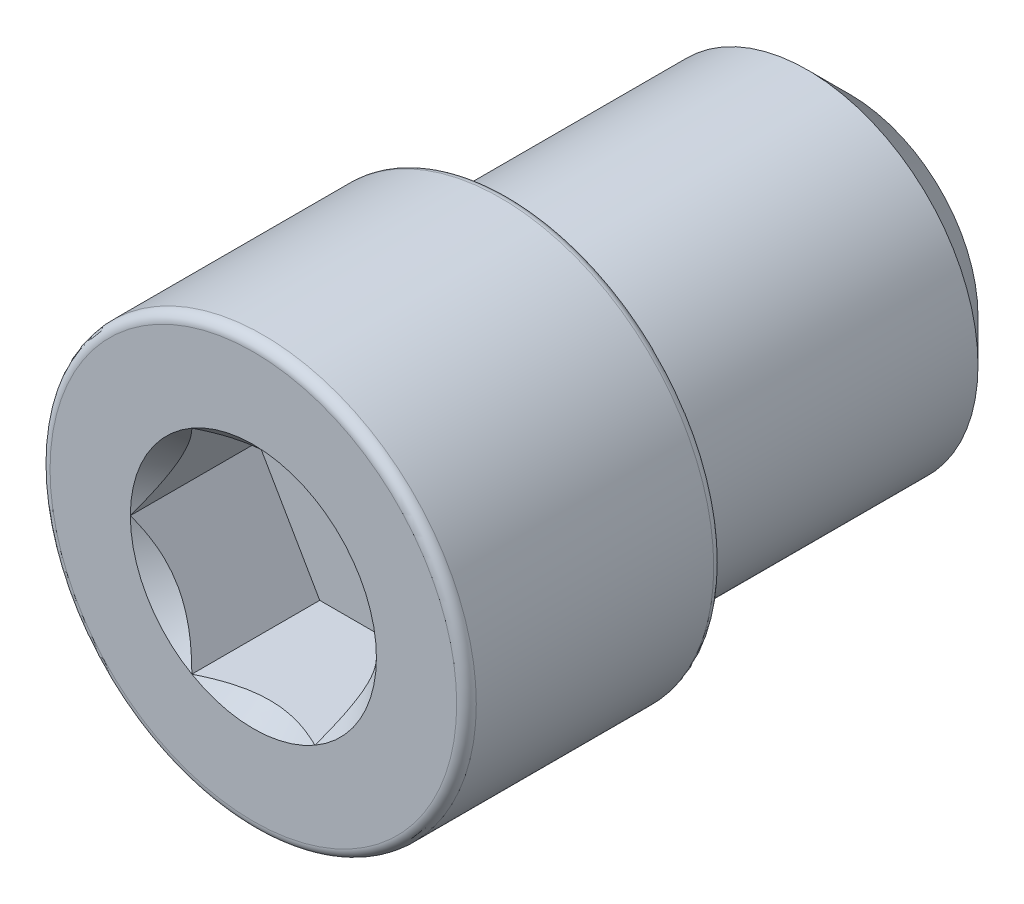
ISO-10303-21;
HEADER;
FILE_DESCRIPTION(('STEP AP214'),'2;1');
FILE_NAME('part.step','',(''),(''),'','','');
FILE_SCHEMA(('AUTOMOTIVE_DESIGN { 1 0 10303 214 1 1 1 1 }'));
ENDSEC;
DATA;
#1=APPLICATION_CONTEXT('core data for automotive mechanical design processes');
#2=APPLICATION_PROTOCOL_DEFINITION('international standard','automotive_design',2000,#1);
#3=PRODUCT_CONTEXT('',#1,'mechanical');
#4=PRODUCT('Part','Part','',(#3));
#5=PRODUCT_RELATED_PRODUCT_CATEGORY('part','',(#4));
#6=PRODUCT_DEFINITION_FORMATION('','',#4);
#7=PRODUCT_DEFINITION_CONTEXT('part definition',#1,'design');
#8=PRODUCT_DEFINITION('design','',#6,#7);
#9=PRODUCT_DEFINITION_SHAPE('','',#8);
#10=(LENGTH_UNIT() NAMED_UNIT(*) SI_UNIT(.MILLI.,.METRE.));
#11=(NAMED_UNIT(*) PLANE_ANGLE_UNIT() SI_UNIT($,.RADIAN.));
#12=(NAMED_UNIT(*) SI_UNIT($,.STERADIAN.) SOLID_ANGLE_UNIT());
#13=UNCERTAINTY_MEASURE_WITH_UNIT(LENGTH_MEASURE(1.E-05),#10,'distance_accuracy_value','');
#14=(GEOMETRIC_REPRESENTATION_CONTEXT(3) GLOBAL_UNCERTAINTY_ASSIGNED_CONTEXT((#13)) GLOBAL_UNIT_ASSIGNED_CONTEXT((#10,
#11,#12)) REPRESENTATION_CONTEXT('',''));
#15=CARTESIAN_POINT('',(0.,0.,0.));
#16=DIRECTION('',(0.,0.,1.));
#17=DIRECTION('',(1.,0.,0.));
#18=AXIS2_PLACEMENT_3D('',#15,#16,#17);
#19=CARTESIAN_POINT('',(0.,0.,8.));
#20=DIRECTION('',(0.,0.,-1.));
#21=DIRECTION('',(-1.,0.,0.));
#22=AXIS2_PLACEMENT_3D('',#19,#20,#21);
#23=CYLINDRICAL_SURFACE('',#22,4.);
#24=CARTESIAN_POINT('',(0.,0.,0.999999999999999));
#25=DIRECTION('',(0.,0.,1.));
#26=DIRECTION('',(1.,0.,0.));
#27=AXIS2_PLACEMENT_3D('',#24,#25,#26);
#28=CIRCLE('',#27,4.);
#29=CARTESIAN_POINT('',(4.,0.,0.999999999999999));
#30=VERTEX_POINT('',#29);
#31=EDGE_CURVE('E313',#30,#30,#28,.T.);
#32=ORIENTED_EDGE('',*,*,#31,.T.);
#33=EDGE_LOOP('',(#32));
#34=FACE_BOUND('',#33,.T.);
#35=CARTESIAN_POINT('',(0.,0.,8.));
#36=DIRECTION('',(0.,0.,1.));
#37=DIRECTION('',(1.,0.,0.));
#38=AXIS2_PLACEMENT_3D('',#35,#36,#37);
#39=CIRCLE('',#38,4.);
#40=CARTESIAN_POINT('',(4.,0.,8.));
#41=VERTEX_POINT('',#40);
#42=EDGE_CURVE('E297',#41,#41,#39,.T.);
#43=ORIENTED_EDGE('',*,*,#42,.F.);
#44=EDGE_LOOP('',(#43));
#45=FACE_BOUND('',#44,.T.);
#46=ADVANCED_FACE('F41',(#34,#45),#23,.T.);
#47=CARTESIAN_POINT('',(0.,0.,0.));
#48=DIRECTION('',(0.,0.,1.));
#49=DIRECTION('',(1.,0.,0.));
#50=AXIS2_PLACEMENT_3D('',#47,#48,#49);
#51=PLANE('',#50);
#52=CARTESIAN_POINT('',(0.,0.,0.));
#53=DIRECTION('',(0.,0.,1.));
#54=DIRECTION('',(1.,0.,0.));
#55=AXIS2_PLACEMENT_3D('',#52,#53,#54);
#56=CIRCLE('',#55,3.);
#57=CARTESIAN_POINT('',(3.,0.,0.));
#58=VERTEX_POINT('',#57);
#59=EDGE_CURVE('E118',#58,#58,#56,.F.);
#60=ORIENTED_EDGE('',*,*,#59,.T.);
#61=EDGE_LOOP('',(#60));
#62=FACE_BOUND('',#61,.T.);
#63=ADVANCED_FACE('F217',(#62),#51,.F.);
#64=CARTESIAN_POINT('',(0.,0.,0.999999999999999));
#65=DIRECTION('',(0.,0.,1.));
#66=DIRECTION('',(1.,0.,0.));
#67=AXIS2_PLACEMENT_3D('',#64,#65,#66);
#68=CONICAL_SURFACE('',#67,4.,0.78539816339745);
#69=ORIENTED_EDGE('',*,*,#59,.F.);
#70=EDGE_LOOP('',(#69));
#71=FACE_BOUND('',#70,.T.);
#72=ORIENTED_EDGE('',*,*,#31,.F.);
#73=EDGE_LOOP('',(#72));
#74=FACE_BOUND('',#73,.T.);
#75=ADVANCED_FACE('F223',(#71,#74),#68,.T.);
#76=CARTESIAN_POINT('',(0.,0.,14.));
#77=DIRECTION('',(0.,0.,-1.));
#78=DIRECTION('',(-1.,0.,0.));
#79=AXIS2_PLACEMENT_3D('',#76,#77,#78);
#80=CYLINDRICAL_SURFACE('',#79,5.);
#81=CARTESIAN_POINT('',(0.,0.,8.2));
#82=DIRECTION('',(0.,0.,1.));
#83=DIRECTION('',(1.,0.,0.));
#84=AXIS2_PLACEMENT_3D('',#81,#82,#83);
#85=CIRCLE('',#84,5.);
#86=CARTESIAN_POINT('',(5.,0.,8.2));
#87=VERTEX_POINT('',#86);
#88=EDGE_CURVE('E50',#87,#87,#85,.T.);
#89=ORIENTED_EDGE('',*,*,#88,.T.);
#90=EDGE_LOOP('',(#89));
#91=FACE_BOUND('',#90,.T.);
#92=CARTESIAN_POINT('',(0.,0.,13.77));
#93=DIRECTION('',(0.,0.,1.));
#94=DIRECTION('',(1.,0.,0.));
#95=AXIS2_PLACEMENT_3D('',#92,#93,#94);
#96=CIRCLE('',#95,5.);
#97=CARTESIAN_POINT('',(5.,0.,13.77));
#98=VERTEX_POINT('',#97);
#99=EDGE_CURVE('E244',#98,#98,#96,.F.);
#100=ORIENTED_EDGE('',*,*,#99,.T.);
#101=EDGE_LOOP('',(#100));
#102=FACE_BOUND('',#101,.T.);
#103=ADVANCED_FACE('F231',(#91,#102),#80,.T.);
#104=CARTESIAN_POINT('',(0.,0.,14.));
#105=DIRECTION('',(0.,0.,1.));
#106=DIRECTION('',(1.,0.,0.));
#107=AXIS2_PLACEMENT_3D('',#104,#105,#106);
#108=PLANE('',#107);
#109=CARTESIAN_POINT('',(0.,0.,14.));
#110=DIRECTION('',(0.,0.,1.));
#111=DIRECTION('',(1.,0.,0.));
#112=AXIS2_PLACEMENT_3D('',#109,#110,#111);
#113=CIRCLE('',#112,4.77);
#114=CARTESIAN_POINT('',(4.77,0.,14.));
#115=VERTEX_POINT('',#114);
#116=EDGE_CURVE('E117',#115,#115,#113,.T.);
#117=ORIENTED_EDGE('',*,*,#116,.T.);
#118=EDGE_LOOP('',(#117));
#119=FACE_BOUND('',#118,.T.);
#120=CARTESIAN_POINT('',(0.,0.,14.));
#121=DIRECTION('',(0.,0.,1.));
#122=DIRECTION('',(1.,0.,0.));
#123=AXIS2_PLACEMENT_3D('',#120,#121,#122);
#124=CIRCLE('',#123,2.88675134594813);
#125=CARTESIAN_POINT('',(2.88675134594813,0.,14.));
#126=VERTEX_POINT('',#125);
#127=CARTESIAN_POINT('',(1.44337567297406,2.5,14.));
#128=VERTEX_POINT('',#127);
#129=EDGE_CURVE('E96',#126,#128,#124,.T.);
#130=ORIENTED_EDGE('',*,*,#129,.F.);
#131=CARTESIAN_POINT('',(1.44337567297406,-2.5,14.));
#132=VERTEX_POINT('',#131);
#133=EDGE_CURVE('E56',#132,#126,#124,.T.);
#134=ORIENTED_EDGE('',*,*,#133,.F.);
#135=CARTESIAN_POINT('',(-1.44337567297407,-2.5,14.));
#136=VERTEX_POINT('',#135);
#137=EDGE_CURVE('E330',#136,#132,#124,.T.);
#138=ORIENTED_EDGE('',*,*,#137,.F.);
#139=CARTESIAN_POINT('',(-2.88675134594813,0.,14.));
#140=VERTEX_POINT('',#139);
#141=EDGE_CURVE('E63',#140,#136,#124,.T.);
#142=ORIENTED_EDGE('',*,*,#141,.F.);
#143=CARTESIAN_POINT('',(-1.44337567297406,2.5,14.));
#144=VERTEX_POINT('',#143);
#145=EDGE_CURVE('E141',#144,#140,#124,.T.);
#146=ORIENTED_EDGE('',*,*,#145,.F.);
#147=EDGE_CURVE('E106',#128,#144,#124,.T.);
#148=ORIENTED_EDGE('',*,*,#147,.F.);
#149=EDGE_LOOP('',(#130,#134,#138,#142,#146,#148));
#150=FACE_BOUND('',#149,.T.);
#151=ADVANCED_FACE('F140',(#119,#150),#108,.T.);
#152=CARTESIAN_POINT('',(0.,0.,8.));
#153=DIRECTION('',(0.,0.,1.));
#154=DIRECTION('',(1.,0.,0.));
#155=AXIS2_PLACEMENT_3D('',#152,#153,#154);
#156=PLANE('',#155);
#157=CARTESIAN_POINT('',(0.,0.,8.));
#158=DIRECTION('',(0.,0.,1.));
#159=DIRECTION('',(1.,0.,0.));
#160=AXIS2_PLACEMENT_3D('',#157,#158,#159);
#161=CIRCLE('',#160,4.8);
#162=CARTESIAN_POINT('',(4.8,0.,8.));
#163=VERTEX_POINT('',#162);
#164=EDGE_CURVE('E11',#163,#163,#161,.F.);
#165=ORIENTED_EDGE('',*,*,#164,.T.);
#166=EDGE_LOOP('',(#165));
#167=FACE_BOUND('',#166,.T.);
#168=ORIENTED_EDGE('',*,*,#42,.T.);
#169=EDGE_LOOP('',(#168));
#170=FACE_BOUND('',#169,.T.);
#171=ADVANCED_FACE('F261',(#167,#170),#156,.F.);
#172=CARTESIAN_POINT('',(0.,0.,14.));
#173=DIRECTION('',(0.,0.,1.));
#174=DIRECTION('',(1.,0.,0.));
#175=AXIS2_PLACEMENT_3D('',#172,#173,#174);
#176=CONICAL_SURFACE('',#175,2.88675134594813,0.785398163397449);
#177=ORIENTED_EDGE('',*,*,#147,.T.);
#178=CARTESIAN_POINT('',(-2.77020364052285,2.5,14.8447400730379));
#179=CARTESIAN_POINT('',(-2.7022410555542,2.5,14.7942972270805));
#180=CARTESIAN_POINT('',(-2.6338863180949,2.5,14.7443742833945));
#181=CARTESIAN_POINT('',(-2.49624219762247,2.5,14.6457965635655));
#182=CARTESIAN_POINT('',(-2.42695257289823,2.5,14.5971421253073));
#183=CARTESIAN_POINT('',(-2.28678261719516,2.5,14.5009852194684));
#184=CARTESIAN_POINT('',(-2.21589411726429,2.5,14.4534946118865));
#185=CARTESIAN_POINT('',(-2.07289802004976,2.5,14.3603950480203));
#186=CARTESIAN_POINT('',(-2.00079051163237,2.5,14.3147859553995));
#187=CARTESIAN_POINT('',(-1.85136748268391,2.5,14.223534533852));
#188=CARTESIAN_POINT('',(-1.77397645614702,2.5,14.1780144838424));
#189=CARTESIAN_POINT('',(-1.61742302073495,2.5,14.0901374331846));
#190=CARTESIAN_POINT('',(-1.53826031232211,2.5,14.0477809727346));
#191=CARTESIAN_POINT('',(-1.29823189324208,2.5,13.926836843479));
#192=CARTESIAN_POINT('',(-1.13426106122491,2.5,13.8540166137058));
#193=CARTESIAN_POINT('',(-0.88711137742321,2.5,13.7649649600375));
#194=CARTESIAN_POINT('',(-0.807344623847814,2.5,13.7392349869911));
#195=CARTESIAN_POINT('',(-0.645977303205611,2.5,13.6941946828386));
#196=CARTESIAN_POINT('',(-0.564376601152635,2.5,13.6748848259425));
#197=CARTESIAN_POINT('',(-0.401145739824866,2.5,13.6439823848152));
#198=CARTESIAN_POINT('',(-0.319539757140577,2.5,13.6322639530117));
#199=CARTESIAN_POINT('',(-0.155573727460264,2.5,13.6167559106768));
#200=CARTESIAN_POINT('',(-0.073213792406259,2.5,13.6129651416756));
#201=CARTESIAN_POINT('',(0.0889406015319165,2.5,13.6135562743385));
#202=CARTESIAN_POINT('',(0.168736083218812,2.5,13.6176904853404));
#203=CARTESIAN_POINT('',(0.327588899148969,2.5,13.6333802859842));
#204=CARTESIAN_POINT('',(0.406646157736193,2.5,13.6449366279878));
#205=CARTESIAN_POINT('',(0.56478820419692,2.5,13.6750548405729));
#206=CARTESIAN_POINT('',(0.643850663729499,2.5,13.6937323379977));
#207=CARTESIAN_POINT('',(0.800257176655641,2.5,13.7371330825706));
#208=CARTESIAN_POINT('',(0.877601408561831,2.5,13.7618556984357));
#209=CARTESIAN_POINT('',(1.12635295184178,2.5,13.8505231510706));
#210=CARTESIAN_POINT('',(1.29410071433186,2.5,13.9247783131875));
#211=CARTESIAN_POINT('',(1.53952732574041,2.5,14.0484079316819));
#212=CARTESIAN_POINT('',(1.6204595062186,2.5,14.0917581216177));
#213=CARTESIAN_POINT('',(1.78047620840828,2.5,14.1817519809863));
#214=CARTESIAN_POINT('',(1.8595610677958,2.5,14.2283950421378));
#215=CARTESIAN_POINT('',(2.01217084338596,2.5,14.3218905285226));
#216=CARTESIAN_POINT('',(2.08577537489079,2.5,14.3686144975002));
#217=CARTESIAN_POINT('',(2.23172389872327,2.5,14.4640011850434));
#218=CARTESIAN_POINT('',(2.30406779409796,2.5,14.5126640517881));
#219=CARTESIAN_POINT('',(2.44706675369514,2.5,14.6111718294146));
#220=CARTESIAN_POINT('',(2.51773081098517,2.5,14.6610037396425));
#221=CARTESIAN_POINT('',(2.65809766562528,2.5,14.7619649538652));
#222=CARTESIAN_POINT('',(2.72780072102036,2.5,14.8130938986832));
#223=CARTESIAN_POINT('',(2.79710236410189,2.5,14.8647525705185));
#224=B_SPLINE_CURVE_WITH_KNOTS('',3,(#178,#179,#180,#181,#182,#183,#184,#185,#186,#187,#188,
#189,#190,#191,#192,#193,#194,#195,#196,#197,#198,#199,#200,#201,#202,#203,#204,#205,#206,#207,
#208,#209,#210,#211,#212,#213,#214,#215,#216,#217,#218,#219,#220,#221,#222,#223),.UNSPECIFIED.,
.F.,.F.,(4,2,2,2,2,2,2,2,2,2,2,2,2,2,2,2,2,2,2,2,2,2,4),(0.,0.253915366386489,0.507897689777923,
0.763849697667828,1.01978312631941,1.28906200278226,1.55838675530061,2.09503555889923,
2.34626885307445,2.59752070001156,2.84449292076577,3.09142904893306,3.33077296578897,
3.57014114813028,3.81357397946407,4.05698140030714,4.60559640961545,4.88100918549167,
5.15637121771764,5.41788736617485,5.67942353932131,5.93881038934174,6.19812617721562),.UNSPECIFIED.);
#225=EDGE_CURVE('E111',#128,#144,#224,.F.);
#226=ORIENTED_EDGE('',*,*,#225,.F.);
#227=EDGE_LOOP('',(#177,#226));
#228=FACE_BOUND('',#227,.T.);
#229=ADVANCED_FACE('F112',(#228),#176,.F.);
#230=ORIENTED_EDGE('',*,*,#145,.T.);
#231=CARTESIAN_POINT('',(-1.44326020292023,2.5002,14.0001154769818));
#232=CARTESIAN_POINT('',(-1.49287669073468,2.41426172221224,13.9505407053547));
#233=CARTESIAN_POINT('',(-1.5433228376411,2.32688643272425,13.9038774813625));
#234=CARTESIAN_POINT('',(-1.64618811625259,2.14871854383441,13.8184381400383));
#235=CARTESIAN_POINT('',(-1.69861703122359,2.05790899931893,13.779709562406));
#236=CARTESIAN_POINT('',(-1.80433744175986,1.87479587687308,13.7133667038977));
#237=CARTESIAN_POINT('',(-1.85760201171315,1.78253893547066,13.6855856685309));
#238=CARTESIAN_POINT('',(-1.96530378549009,1.59599399122372,13.6427831759107));
#239=CARTESIAN_POINT('',(-2.01973769896306,1.50171168743372,13.6277297666713));
#240=CARTESIAN_POINT('',(-2.11355131286832,1.33922174170816,13.6141477222095));
#241=CARTESIAN_POINT('',(-2.15280980880341,1.27122403211985,13.6121370992408));
#242=CARTESIAN_POINT('',(-2.23126263056549,1.13533975883078,13.6155241171875));
#243=CARTESIAN_POINT('',(-2.27045692907357,1.06745324244776,13.6209243552998));
#244=CARTESIAN_POINT('',(-2.34847544336504,0.932321211763897,13.6388257884025));
#245=CARTESIAN_POINT('',(-2.38729919566122,0.865076500246443,13.6513349270465));
#246=CARTESIAN_POINT('',(-2.46427534467603,0.731749899181805,13.6827675019557));
#247=CARTESIAN_POINT('',(-2.50242779262541,0.665667920900347,13.7016904464968));
#248=CARTESIAN_POINT('',(-2.60015256308361,0.496403653308738,13.7578673614082));
#249=CARTESIAN_POINT('',(-2.65911894852988,0.394270877777109,13.7993558315962));
#250=CARTESIAN_POINT('',(-2.74582384890657,0.244093585059493,13.8693940467231));
#251=CARTESIAN_POINT('',(-2.77439698586412,0.194603460117392,13.8940022521161));
#252=CARTESIAN_POINT('',(-2.83101398781794,0.096539936161154,13.9454618867152));
#253=CARTESIAN_POINT('',(-2.85905816495513,0.0479659965030725,13.9723119387794));
#254=CARTESIAN_POINT('',(-2.88686681600197,-0.000200000000000346,14.0001154769818));
#255=B_SPLINE_CURVE_WITH_KNOTS('',3,(#231,#232,#233,#234,#235,#236,#237,#238,#239,#240,#241,
#242,#243,#244,#245,#246,#247,#248,#249,#250,#251,#252,#253,#254),.UNSPECIFIED.,.F.,.F.,(4,2,2,
2,2,2,2,2,2,2,2,4),(0.,0.333012085133924,0.667964518301397,0.997597032043299,1.32639954393844,
1.56169424147168,1.79707142102083,2.0327121352217,2.2683347877565,2.64260240809533,
2.82922877818864,3.01574133749025),.UNSPECIFIED.);
#256=EDGE_CURVE('E105',#144,#140,#255,.T.);
#257=ORIENTED_EDGE('',*,*,#256,.F.);
#258=EDGE_LOOP('',(#230,#257));
#259=FACE_BOUND('',#258,.T.);
#260=ADVANCED_FACE('F343',(#259),#176,.F.);
#261=ORIENTED_EDGE('',*,*,#141,.T.);
#262=CARTESIAN_POINT('',(-2.88686681600197,0.000199999999999153,14.0001154769818));
#263=CARTESIAN_POINT('',(-2.83725032818751,-0.0857382777877654,13.9505407053547));
#264=CARTESIAN_POINT('',(-2.7868041812811,-0.173113567275754,13.9038774813625));
#265=CARTESIAN_POINT('',(-2.6839389026696,-0.351281456165589,13.8184381400383));
#266=CARTESIAN_POINT('',(-2.6315099876986,-0.442091000681074,13.779709562406));
#267=CARTESIAN_POINT('',(-2.52578957716234,-0.62520412312692,13.7133667038977));
#268=CARTESIAN_POINT('',(-2.47252500720904,-0.717461064529339,13.6855856685309));
#269=CARTESIAN_POINT('',(-2.3648232334321,-0.904006008776284,13.6427831759107));
#270=CARTESIAN_POINT('',(-2.31038931995913,-0.998288312566281,13.6277297666713));
#271=CARTESIAN_POINT('',(-2.21657570605387,-1.16077825829184,13.6141477222095));
#272=CARTESIAN_POINT('',(-2.17731721011878,-1.22877596788015,13.6121370992408));
#273=CARTESIAN_POINT('',(-2.0988643883567,-1.36466024116922,13.6155241171875));
#274=CARTESIAN_POINT('',(-2.05967008984862,-1.43254675755223,13.6209243552998));
#275=CARTESIAN_POINT('',(-1.98165157555715,-1.5676787882361,13.6388257884025));
#276=CARTESIAN_POINT('',(-1.94282782326097,-1.63492349975356,13.6513349270465));
#277=CARTESIAN_POINT('',(-1.86585167424616,-1.76825010081819,13.6827675019557));
#278=CARTESIAN_POINT('',(-1.82769922629678,-1.83433207909965,13.7016904464968));
#279=CARTESIAN_POINT('',(-1.72997445583858,-2.00359634669126,13.7578673614082));
#280=CARTESIAN_POINT('',(-1.67100807039231,-2.10572912222289,13.7993558315962));
#281=CARTESIAN_POINT('',(-1.58430317001562,-2.25590641494051,13.8693940467231));
#282=CARTESIAN_POINT('',(-1.55573003305807,-2.30539653988261,13.8940022521161));
#283=CARTESIAN_POINT('',(-1.49911303110425,-2.40346006383885,13.9454618867152));
#284=CARTESIAN_POINT('',(-1.47106885396706,-2.45203400349693,13.9723119387794));
#285=CARTESIAN_POINT('',(-1.44326020292023,-2.5002,14.0001154769818));
#286=B_SPLINE_CURVE_WITH_KNOTS('',3,(#262,#263,#264,#265,#266,#267,#268,#269,#270,#271,#272,
#273,#274,#275,#276,#277,#278,#279,#280,#281,#282,#283,#284,#285),.UNSPECIFIED.,.F.,.F.,(4,2,2,
2,2,2,2,2,2,2,2,4),(0.,0.333012085133924,0.667964518301396,0.997597032043296,1.32639954393844,
1.56169424147168,1.79707142102082,2.0327121352217,2.2683347877565,2.64260240809533,
2.82922877818864,3.01574133749025),.UNSPECIFIED.);
#287=EDGE_CURVE('E154',#140,#136,#286,.T.);
#288=ORIENTED_EDGE('',*,*,#287,.F.);
#289=EDGE_LOOP('',(#261,#288));
#290=FACE_BOUND('',#289,.T.);
#291=ADVANCED_FACE('F338',(#290),#176,.F.);
#292=ORIENTED_EDGE('',*,*,#137,.T.);
#293=CARTESIAN_POINT('',(-2.77020363749965,-2.5,14.8447400707935));
#294=CARTESIAN_POINT('',(-2.70224105261352,-2.5,14.7942972249221));
#295=CARTESIAN_POINT('',(-2.63388631523702,-2.5,14.744374281322));
#296=CARTESIAN_POINT('',(-2.49624219493107,-2.5,14.6457965616641));
#297=CARTESIAN_POINT('',(-2.4269525702905,-2.5,14.5971421234912));
#298=CARTESIAN_POINT('',(-2.28678261475764,-2.5,14.5009852178235));
#299=CARTESIAN_POINT('',(-2.21589411491334,-2.5,14.4534946103276));
#300=CARTESIAN_POINT('',(-2.07289801787356,-2.5,14.3603950466318));
#301=CARTESIAN_POINT('',(-2.00079050954437,-2.5,14.3147859540954));
#302=CARTESIAN_POINT('',(-1.85136748078596,-2.5,14.2235345327233));
#303=CARTESIAN_POINT('',(-1.77397645435118,-2.5,14.1780144828043));
#304=CARTESIAN_POINT('',(-1.61742301914699,-2.5,14.0901374323232));
#305=CARTESIAN_POINT('',(-1.53826031083992,-2.5,14.0477809719594));
#306=CARTESIAN_POINT('',(-1.29823189208257,-2.5,13.9268368429515));
#307=CARTESIAN_POINT('',(-1.1342610602898,-2.5,13.8540166133308));
#308=CARTESIAN_POINT('',(-0.887111376658194,-2.5,13.7649649597796));
#309=CARTESIAN_POINT('',(-0.807344623014012,-2.5,13.7392349867326));
#310=CARTESIAN_POINT('',(-0.64597730223237,-2.5,13.6941946825928));
#311=CARTESIAN_POINT('',(-0.564376600108744,-2.5,13.6748848257101));
#312=CARTESIAN_POINT('',(-0.401145738642201,-2.5,13.6439823846255));
#313=CARTESIAN_POINT('',(-0.319539755889808,-2.5,13.6322639528508));
#314=CARTESIAN_POINT('',(-0.155573726076,-2.5,13.6167559105885));
#315=CARTESIAN_POINT('',(-0.0732137909566041,-2.5,13.6129651416311));
#316=CARTESIAN_POINT('',(0.088940603111343,-2.5,13.6135562743926));
#317=CARTESIAN_POINT('',(0.168736084862771,-2.5,13.6176904854494));
#318=CARTESIAN_POINT('',(0.327588900916058,-2.5,13.6333802862122));
#319=CARTESIAN_POINT('',(0.406646159561879,-2.5,13.6449366282797));
#320=CARTESIAN_POINT('',(0.564788206138293,-2.5,13.6750548409995));
#321=CARTESIAN_POINT('',(0.643850665727805,-2.5,13.6937323384953));
#322=CARTESIAN_POINT('',(0.800257178762726,-2.5,13.7371330832123));
#323=CARTESIAN_POINT('',(0.877601410720763,-2.5,13.7618556991505));
#324=CARTESIAN_POINT('',(1.12635295448185,-2.5,13.8505231521358));
#325=CARTESIAN_POINT('',(1.29410071737717,-2.5,13.9247783145763));
#326=CARTESIAN_POINT('',(1.53952732936915,-2.5,14.0484079335823));
#327=CARTESIAN_POINT('',(1.62045951003841,-2.5,14.0917581236935));
#328=CARTESIAN_POINT('',(1.78047621260416,-2.5,14.1817519834187));
#329=CARTESIAN_POINT('',(1.85956107217666,-2.5,14.2283950447512));
#330=CARTESIAN_POINT('',(2.01217084810339,-2.5,14.3218905314797));
#331=CARTESIAN_POINT('',(2.0857753797604,-2.5,14.3686145006192));
#332=CARTESIAN_POINT('',(2.23172390389513,-2.5,14.4640011884871));
#333=CARTESIAN_POINT('',(2.3040677994199,-2.5,14.5126640553945));
#334=CARTESIAN_POINT('',(2.44706675931361,-2.5,14.6111718333444));
#335=CARTESIAN_POINT('',(2.51773081675013,-2.5,14.6610037437331));
#336=CARTESIAN_POINT('',(2.6580976716823,-2.5,14.7619649582772));
#337=CARTESIAN_POINT('',(2.72780072722295,-2.5,14.8130939032558));
#338=CARTESIAN_POINT('',(2.7971023704498,-2.5,14.8647525752515));
#339=B_SPLINE_CURVE_WITH_KNOTS('',3,(#293,#294,#295,#296,#297,#298,#299,#300,#301,#302,#303,
#304,#305,#306,#307,#308,#309,#310,#311,#312,#313,#314,#315,#316,#317,#318,#319,#320,#321,#322,
#323,#324,#325,#326,#327,#328,#329,#330,#331,#332,#333,#334,#335,#336,#337,#338),.UNSPECIFIED.,
.F.,.F.,(4,2,2,2,2,2,2,2,2,2,2,2,2,2,2,2,2,2,2,2,2,2,4),(0.,0.253915366034021,0.507897689072883,
0.763849696603631,1.0197831248961,1.28906200095732,1.55838675307382,2.09503555587664,
2.34626885024813,2.59752069738117,2.84449291832419,3.09142904668035,3.33077296373735,
3.57014114627995,3.81357397782878,4.0569813988868,4.60559640969274,4.88100918632302,
5.15637121930272,5.41788736840583,5.67942354219824,5.93881039285584,6.19812618136684),.UNSPECIFIED.);
#340=EDGE_CURVE('E181',#136,#132,#339,.T.);
#341=ORIENTED_EDGE('',*,*,#340,.F.);
#342=EDGE_LOOP('',(#292,#341));
#343=FACE_BOUND('',#342,.T.);
#344=ADVANCED_FACE('F331',(#343),#176,.F.);
#345=ORIENTED_EDGE('',*,*,#133,.T.);
#346=CARTESIAN_POINT('',(1.44326020292023,-2.5002,14.0001154769818));
#347=CARTESIAN_POINT('',(1.49287669073468,-2.41426172221224,13.9505407053547));
#348=CARTESIAN_POINT('',(1.5433228376411,-2.32688643272425,13.9038774813625));
#349=CARTESIAN_POINT('',(1.64618811625259,-2.14871854383441,13.8184381400383));
#350=CARTESIAN_POINT('',(1.69861703122359,-2.05790899931893,13.779709562406));
#351=CARTESIAN_POINT('',(1.80433744175986,-1.87479587687308,13.7133667038977));
#352=CARTESIAN_POINT('',(1.85760201171315,-1.78253893547066,13.6855856685309));
#353=CARTESIAN_POINT('',(1.96530378549009,-1.59599399122372,13.6427831759107));
#354=CARTESIAN_POINT('',(2.01973769896306,-1.50171168743372,13.6277297666713));
#355=CARTESIAN_POINT('',(2.11355131286833,-1.33922174170816,13.6141477222095));
#356=CARTESIAN_POINT('',(2.15280980880341,-1.27122403211985,13.6121370992408));
#357=CARTESIAN_POINT('',(2.23126263056549,-1.13533975883078,13.6155241171875));
#358=CARTESIAN_POINT('',(2.27045692907357,-1.06745324244776,13.6209243552998));
#359=CARTESIAN_POINT('',(2.34847544336504,-0.932321211763896,13.6388257884025));
#360=CARTESIAN_POINT('',(2.38729919566123,-0.865076500246442,13.6513349270465));
#361=CARTESIAN_POINT('',(2.46427534467603,-0.731749899181803,13.6827675019557));
#362=CARTESIAN_POINT('',(2.50242779262542,-0.665667920900346,13.7016904464968));
#363=CARTESIAN_POINT('',(2.60015256308361,-0.496403653308738,13.7578673614082));
#364=CARTESIAN_POINT('',(2.65911894852988,-0.394270877777109,13.7993558315962));
#365=CARTESIAN_POINT('',(2.74582384890657,-0.244093585059492,13.8693940467231));
#366=CARTESIAN_POINT('',(2.77439698586412,-0.194603460117391,13.8940022521161));
#367=CARTESIAN_POINT('',(2.83101398781794,-0.0965399361611534,13.9454618867152));
#368=CARTESIAN_POINT('',(2.85905816495513,-0.0479659965030719,13.9723119387794));
#369=CARTESIAN_POINT('',(2.88686681600197,0.00020000000000026,14.0001154769818));
#370=B_SPLINE_CURVE_WITH_KNOTS('',3,(#346,#347,#348,#349,#350,#351,#352,#353,#354,#355,#356,
#357,#358,#359,#360,#361,#362,#363,#364,#365,#366,#367,#368,#369),.UNSPECIFIED.,.F.,.F.,(4,2,2,
2,2,2,2,2,2,2,2,4),(0.,0.333012085133924,0.667964518301397,0.997597032043299,1.32639954393844,
1.56169424147169,1.79707142102083,2.03271213522171,2.2683347877565,2.64260240809533,
2.82922877818864,3.01574133749025),.UNSPECIFIED.);
#371=EDGE_CURVE('E129',#132,#126,#370,.T.);
#372=ORIENTED_EDGE('',*,*,#371,.F.);
#373=EDGE_LOOP('',(#345,#372));
#374=FACE_BOUND('',#373,.T.);
#375=ADVANCED_FACE('F168',(#374),#176,.F.);
#376=ORIENTED_EDGE('',*,*,#129,.T.);
#377=CARTESIAN_POINT('',(2.88686681600197,-0.000199999999999798,14.0001154769818));
#378=CARTESIAN_POINT('',(2.83725032818751,0.0857382777877654,13.9505407053547));
#379=CARTESIAN_POINT('',(2.7868041812811,0.173113567275754,13.9038774813625));
#380=CARTESIAN_POINT('',(2.6839389026696,0.351281456165589,13.8184381400383));
#381=CARTESIAN_POINT('',(2.6315099876986,0.442091000681075,13.779709562406));
#382=CARTESIAN_POINT('',(2.52578957716234,0.625204123126921,13.7133667038977));
#383=CARTESIAN_POINT('',(2.47252500720904,0.717461064529341,13.6855856685309));
#384=CARTESIAN_POINT('',(2.3648232334321,0.904006008776286,13.6427831759107));
#385=CARTESIAN_POINT('',(2.31038931995913,0.998288312566283,13.6277297666713));
#386=CARTESIAN_POINT('',(2.21657570605387,1.16077825829184,13.6141477222095));
#387=CARTESIAN_POINT('',(2.17731721011878,1.22877596788015,13.6121370992408));
#388=CARTESIAN_POINT('',(2.0988643883567,1.36466024116922,13.6155241171875));
#389=CARTESIAN_POINT('',(2.05967008984862,1.43254675755224,13.6209243552998));
#390=CARTESIAN_POINT('',(1.98165157555715,1.5676787882361,13.6388257884025));
#391=CARTESIAN_POINT('',(1.94282782326097,1.63492349975356,13.6513349270465));
#392=CARTESIAN_POINT('',(1.86585167424616,1.7682501008182,13.6827675019557));
#393=CARTESIAN_POINT('',(1.82769922629678,1.83433207909965,13.7016904464968));
#394=CARTESIAN_POINT('',(1.72997445583858,2.00359634669126,13.7578673614082));
#395=CARTESIAN_POINT('',(1.67100807039231,2.10572912222289,13.7993558315962));
#396=CARTESIAN_POINT('',(1.58430317001562,2.25590641494051,13.8693940467231));
#397=CARTESIAN_POINT('',(1.55573003305807,2.30539653988261,13.8940022521161));
#398=CARTESIAN_POINT('',(1.49911303110426,2.40346006383885,13.9454618867152));
#399=CARTESIAN_POINT('',(1.47106885396706,2.45203400349693,13.9723119387794));
#400=CARTESIAN_POINT('',(1.44326020292023,2.5002,14.0001154769818));
#401=B_SPLINE_CURVE_WITH_KNOTS('',3,(#377,#378,#379,#380,#381,#382,#383,#384,#385,#386,#387,
#388,#389,#390,#391,#392,#393,#394,#395,#396,#397,#398,#399,#400),.UNSPECIFIED.,.F.,.F.,(4,2,2,
2,2,2,2,2,2,2,2,4),(0.,0.333012085133925,0.667964518301398,0.997597032043299,1.32639954393844,
1.56169424147169,1.79707142102083,2.03271213522171,2.2683347877565,2.64260240809533,
2.82922877818864,3.01574133749025),.UNSPECIFIED.);
#402=EDGE_CURVE('E100',#126,#128,#401,.T.);
#403=ORIENTED_EDGE('',*,*,#402,.F.);
#404=EDGE_LOOP('',(#376,#403));
#405=FACE_BOUND('',#404,.T.);
#406=ADVANCED_FACE('F98',(#405),#176,.F.);
#407=CARTESIAN_POINT('',(0.,0.,11.));
#408=DIRECTION('',(0.,0.,1.));
#409=DIRECTION('',(1.,0.,0.));
#410=AXIS2_PLACEMENT_3D('',#407,#408,#409);
#411=PLANE('',#410);
#412=DIRECTION('',(-0.5,0.866025403784439,0.));
#413=VECTOR('',#412,1.);
#414=CARTESIAN_POINT('',(2.88675134594813,0.,11.));
#415=LINE('',#414,#413);
#416=CARTESIAN_POINT('',(2.88675134594813,0.,11.));
#417=VERTEX_POINT('',#416);
#418=CARTESIAN_POINT('',(1.44337567297406,2.5,11.));
#419=VERTEX_POINT('',#418);
#420=EDGE_CURVE('E128',#417,#419,#415,.T.);
#421=ORIENTED_EDGE('',*,*,#420,.T.);
#422=DIRECTION('',(-1.,0.,0.));
#423=VECTOR('',#422,1.);
#424=CARTESIAN_POINT('',(1.44337567297406,2.5,11.));
#425=LINE('',#424,#423);
#426=CARTESIAN_POINT('',(-1.44337567297406,2.5,11.));
#427=VERTEX_POINT('',#426);
#428=EDGE_CURVE('E133',#419,#427,#425,.T.);
#429=ORIENTED_EDGE('',*,*,#428,.T.);
#430=DIRECTION('',(-0.5,-0.866025403784439,0.));
#431=VECTOR('',#430,1.);
#432=CARTESIAN_POINT('',(-1.44337567297406,2.5,11.));
#433=LINE('',#432,#431);
#434=CARTESIAN_POINT('',(-2.88675134594813,0.,11.));
#435=VERTEX_POINT('',#434);
#436=EDGE_CURVE('E281',#427,#435,#433,.T.);
#437=ORIENTED_EDGE('',*,*,#436,.T.);
#438=DIRECTION('',(0.5,-0.866025403784439,0.));
#439=VECTOR('',#438,1.);
#440=CARTESIAN_POINT('',(-2.88675134594813,0.,11.));
#441=LINE('',#440,#439);
#442=CARTESIAN_POINT('',(-1.44337567297406,-2.5,11.));
#443=VERTEX_POINT('',#442);
#444=EDGE_CURVE('E286',#435,#443,#441,.T.);
#445=ORIENTED_EDGE('',*,*,#444,.T.);
#446=DIRECTION('',(1.,0.,0.));
#447=VECTOR('',#446,1.);
#448=CARTESIAN_POINT('',(-1.44337567297406,-2.5,11.));
#449=LINE('',#448,#447);
#450=CARTESIAN_POINT('',(1.44337567297406,-2.5,11.));
#451=VERTEX_POINT('',#450);
#452=EDGE_CURVE('E290',#443,#451,#449,.T.);
#453=ORIENTED_EDGE('',*,*,#452,.T.);
#454=DIRECTION('',(0.5,0.866025403784439,0.));
#455=VECTOR('',#454,1.);
#456=CARTESIAN_POINT('',(1.44337567297406,-2.5,11.));
#457=LINE('',#456,#455);
#458=EDGE_CURVE('E137',#451,#417,#457,.T.);
#459=ORIENTED_EDGE('',*,*,#458,.T.);
#460=EDGE_LOOP('',(#421,#429,#437,#445,#453,#459));
#461=FACE_BOUND('',#460,.T.);
#462=ADVANCED_FACE('F167',(#461),#411,.T.);
#463=CARTESIAN_POINT('',(1.44337567297406,2.5,11.));
#464=DIRECTION('',(0.,1.,0.));
#465=DIRECTION('',(-1.,0.,0.));
#466=AXIS2_PLACEMENT_3D('',#463,#464,#465);
#467=PLANE('',#466);
#468=DIRECTION('',(0.,0.,1.));
#469=VECTOR('',#468,1.);
#470=CARTESIAN_POINT('',(1.44337567297406,2.5,11.));
#471=LINE('',#470,#469);
#472=EDGE_CURVE('E124',#419,#128,#471,.T.);
#473=ORIENTED_EDGE('',*,*,#472,.T.);
#474=ORIENTED_EDGE('',*,*,#225,.T.);
#475=DIRECTION('',(0.,0.,1.));
#476=VECTOR('',#475,1.);
#477=CARTESIAN_POINT('',(-1.44337567297406,2.5,11.));
#478=LINE('',#477,#476);
#479=EDGE_CURVE('E136',#427,#144,#478,.T.);
#480=ORIENTED_EDGE('',*,*,#479,.F.);
#481=ORIENTED_EDGE('',*,*,#428,.F.);
#482=EDGE_LOOP('',(#473,#474,#480,#481));
#483=FACE_BOUND('',#482,.T.);
#484=ADVANCED_FACE('F131',(#483),#467,.F.);
#485=CARTESIAN_POINT('',(-1.44337567297406,2.5,11.));
#486=DIRECTION('',(-0.866025403784439,0.5,0.));
#487=DIRECTION('',(-0.5,-0.866025403784439,0.));
#488=AXIS2_PLACEMENT_3D('',#485,#486,#487);
#489=PLANE('',#488);
#490=ORIENTED_EDGE('',*,*,#479,.T.);
#491=ORIENTED_EDGE('',*,*,#256,.T.);
#492=DIRECTION('',(0.,0.,1.));
#493=VECTOR('',#492,1.);
#494=CARTESIAN_POINT('',(-2.88675134594813,0.,11.));
#495=LINE('',#494,#493);
#496=EDGE_CURVE('E305',#435,#140,#495,.T.);
#497=ORIENTED_EDGE('',*,*,#496,.F.);
#498=ORIENTED_EDGE('',*,*,#436,.F.);
#499=EDGE_LOOP('',(#490,#491,#497,#498));
#500=FACE_BOUND('',#499,.T.);
#501=ADVANCED_FACE('F161',(#500),#489,.F.);
#502=CARTESIAN_POINT('',(-2.88675134594813,0.,11.));
#503=DIRECTION('',(-0.866025403784439,-0.5,0.));
#504=DIRECTION('',(0.5,-0.866025403784439,0.));
#505=AXIS2_PLACEMENT_3D('',#502,#503,#504);
#506=PLANE('',#505);
#507=ORIENTED_EDGE('',*,*,#496,.T.);
#508=ORIENTED_EDGE('',*,*,#287,.T.);
#509=DIRECTION('',(0.,0.,1.));
#510=VECTOR('',#509,1.);
#511=CARTESIAN_POINT('',(-1.44337567297406,-2.5,11.));
#512=LINE('',#511,#510);
#513=EDGE_CURVE('E301',#443,#136,#512,.T.);
#514=ORIENTED_EDGE('',*,*,#513,.F.);
#515=ORIENTED_EDGE('',*,*,#444,.F.);
#516=EDGE_LOOP('',(#507,#508,#514,#515));
#517=FACE_BOUND('',#516,.T.);
#518=ADVANCED_FACE('F206',(#517),#506,.F.);
#519=CARTESIAN_POINT('',(-1.44337567297406,-2.5,11.));
#520=DIRECTION('',(0.,-1.,0.));
#521=DIRECTION('',(1.,0.,0.));
#522=AXIS2_PLACEMENT_3D('',#519,#520,#521);
#523=PLANE('',#522);
#524=ORIENTED_EDGE('',*,*,#513,.T.);
#525=ORIENTED_EDGE('',*,*,#340,.T.);
#526=DIRECTION('',(0.,0.,1.));
#527=VECTOR('',#526,1.);
#528=CARTESIAN_POINT('',(1.44337567297406,-2.5,11.));
#529=LINE('',#528,#527);
#530=EDGE_CURVE('E298',#451,#132,#529,.T.);
#531=ORIENTED_EDGE('',*,*,#530,.F.);
#532=ORIENTED_EDGE('',*,*,#452,.F.);
#533=EDGE_LOOP('',(#524,#525,#531,#532));
#534=FACE_BOUND('',#533,.T.);
#535=ADVANCED_FACE('F202',(#534),#523,.F.);
#536=CARTESIAN_POINT('',(1.44337567297406,-2.5,11.));
#537=DIRECTION('',(0.866025403784439,-0.5,0.));
#538=DIRECTION('',(0.5,0.866025403784439,0.));
#539=AXIS2_PLACEMENT_3D('',#536,#537,#538);
#540=PLANE('',#539);
#541=ORIENTED_EDGE('',*,*,#530,.T.);
#542=ORIENTED_EDGE('',*,*,#371,.T.);
#543=DIRECTION('',(0.,0.,1.));
#544=VECTOR('',#543,1.);
#545=CARTESIAN_POINT('',(2.88675134594813,0.,11.));
#546=LINE('',#545,#544);
#547=EDGE_CURVE('E126',#417,#126,#546,.T.);
#548=ORIENTED_EDGE('',*,*,#547,.F.);
#549=ORIENTED_EDGE('',*,*,#458,.F.);
#550=EDGE_LOOP('',(#541,#542,#548,#549));
#551=FACE_BOUND('',#550,.T.);
#552=ADVANCED_FACE('F199',(#551),#540,.F.);
#553=CARTESIAN_POINT('',(2.88675134594813,0.,11.));
#554=DIRECTION('',(0.866025403784438,0.5,0.));
#555=DIRECTION('',(-0.5,0.866025403784439,0.));
#556=AXIS2_PLACEMENT_3D('',#553,#554,#555);
#557=PLANE('',#556);
#558=ORIENTED_EDGE('',*,*,#547,.T.);
#559=ORIENTED_EDGE('',*,*,#402,.T.);
#560=ORIENTED_EDGE('',*,*,#472,.F.);
#561=ORIENTED_EDGE('',*,*,#420,.F.);
#562=EDGE_LOOP('',(#558,#559,#560,#561));
#563=FACE_BOUND('',#562,.T.);
#564=ADVANCED_FACE('F122',(#563),#557,.F.);
#565=CARTESIAN_POINT('',(0.,0.,13.77));
#566=DIRECTION('',(0.,0.,1.));
#567=DIRECTION('',(1.,0.,0.));
#568=AXIS2_PLACEMENT_3D('',#565,#566,#567);
#569=TOROIDAL_SURFACE('',#568,4.77,0.23);
#570=ORIENTED_EDGE('',*,*,#99,.F.);
#571=EDGE_LOOP('',(#570));
#572=FACE_BOUND('',#571,.T.);
#573=ORIENTED_EDGE('',*,*,#116,.F.);
#574=EDGE_LOOP('',(#573));
#575=FACE_BOUND('',#574,.T.);
#576=ADVANCED_FACE('F233',(#572,#575),#569,.T.);
#577=CARTESIAN_POINT('',(0.,0.,8.2));
#578=DIRECTION('',(0.,0.,1.));
#579=DIRECTION('',(1.,0.,0.));
#580=AXIS2_PLACEMENT_3D('',#577,#578,#579);
#581=TOROIDAL_SURFACE('',#580,4.8,0.2);
#582=ORIENTED_EDGE('',*,*,#164,.F.);
#583=EDGE_LOOP('',(#582));
#584=FACE_BOUND('',#583,.T.);
#585=ORIENTED_EDGE('',*,*,#88,.F.);
#586=EDGE_LOOP('',(#585));
#587=FACE_BOUND('',#586,.T.);
#588=ADVANCED_FACE('F43',(#584,#587),#581,.T.);
#589=CLOSED_SHELL('',(#46,#63,#75,#103,#151,#171,#229,#260,#291,#344,#375,#406,#462,#484,#501,
#518,#535,#552,#564,#576,#588));
#590=MANIFOLD_SOLID_BREP('B2',#589);
#591=ADVANCED_BREP_SHAPE_REPRESENTATION('',(#18,#590),#14);
#592=SHAPE_DEFINITION_REPRESENTATION(#9,#591);
ENDSEC;
END-ISO-10303-21;
